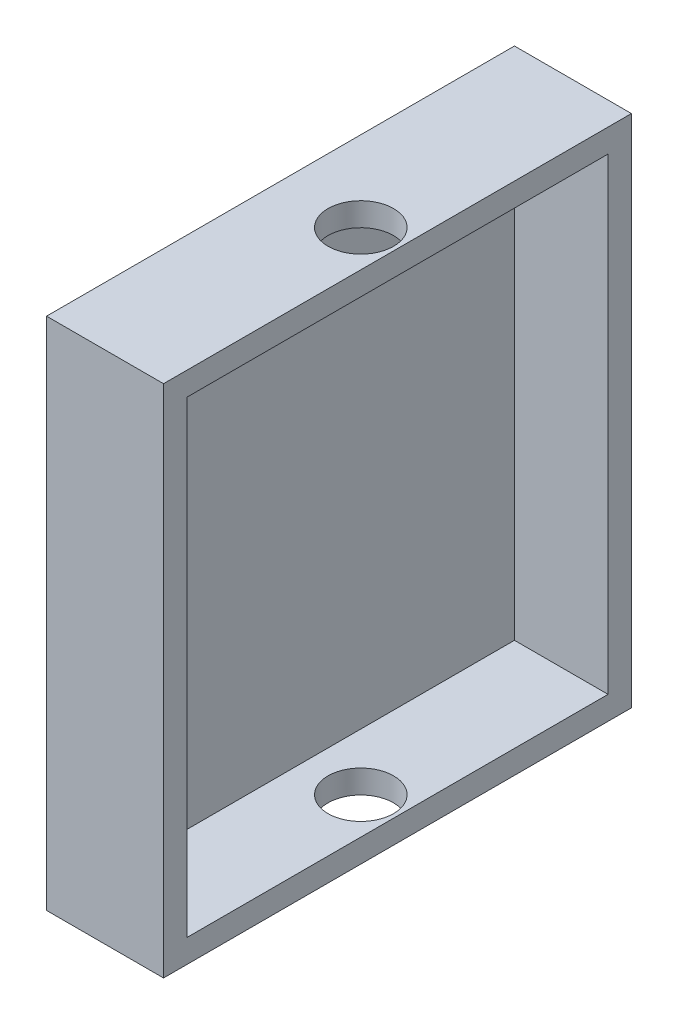
ISO-10303-21;
HEADER;
FILE_DESCRIPTION(('STEP AP214'),'2;1');
FILE_NAME('part.step','',(''),(''),'','','');
FILE_SCHEMA(('AUTOMOTIVE_DESIGN { 1 0 10303 214 1 1 1 1 }'));
ENDSEC;
DATA;
#1=APPLICATION_CONTEXT('core data for automotive mechanical design processes');
#2=APPLICATION_PROTOCOL_DEFINITION('international standard','automotive_design',2000,#1);
#3=PRODUCT_CONTEXT('',#1,'mechanical');
#4=PRODUCT('Part','Part','',(#3));
#5=PRODUCT_RELATED_PRODUCT_CATEGORY('part','',(#4));
#6=PRODUCT_DEFINITION_FORMATION('','',#4);
#7=PRODUCT_DEFINITION_CONTEXT('part definition',#1,'design');
#8=PRODUCT_DEFINITION('design','',#6,#7);
#9=PRODUCT_DEFINITION_SHAPE('','',#8);
#10=(LENGTH_UNIT() NAMED_UNIT(*) SI_UNIT(.MILLI.,.METRE.));
#11=(NAMED_UNIT(*) PLANE_ANGLE_UNIT() SI_UNIT($,.RADIAN.));
#12=(NAMED_UNIT(*) SI_UNIT($,.STERADIAN.) SOLID_ANGLE_UNIT());
#13=UNCERTAINTY_MEASURE_WITH_UNIT(LENGTH_MEASURE(1.E-05),#10,'distance_accuracy_value','');
#14=(GEOMETRIC_REPRESENTATION_CONTEXT(3) GLOBAL_UNCERTAINTY_ASSIGNED_CONTEXT((#13)) GLOBAL_UNIT_ASSIGNED_CONTEXT((#10,
#11,#12)) REPRESENTATION_CONTEXT('',''));
#15=CARTESIAN_POINT('',(0.,0.,0.));
#16=DIRECTION('',(0.,0.,1.));
#17=DIRECTION('',(1.,0.,0.));
#18=AXIS2_PLACEMENT_3D('',#15,#16,#17);
#19=CARTESIAN_POINT('',(0.,0.,0.));
#20=DIRECTION('',(1.,0.,0.));
#21=DIRECTION('',(0.,0.,-1.));
#22=AXIS2_PLACEMENT_3D('',#19,#20,#21);
#23=PLANE('',#22);
#24=DIRECTION('',(0.,0.,-1.));
#25=VECTOR('',#24,1.);
#26=CARTESIAN_POINT('',(0.,-55.,0.));
#27=LINE('',#26,#25);
#28=CARTESIAN_POINT('',(0.,-55.,50.));
#29=VERTEX_POINT('',#28);
#30=CARTESIAN_POINT('',(0.,-55.,-50.));
#31=VERTEX_POINT('',#30);
#32=EDGE_CURVE('E247',#29,#31,#27,.T.);
#33=ORIENTED_EDGE('',*,*,#32,.F.);
#34=DIRECTION('',(0.,1.,0.));
#35=VECTOR('',#34,1.);
#36=CARTESIAN_POINT('',(0.,0.,50.));
#37=LINE('',#36,#35);
#38=CARTESIAN_POINT('',(0.,55.,50.));
#39=VERTEX_POINT('',#38);
#40=EDGE_CURVE('E259',#29,#39,#37,.T.);
#41=ORIENTED_EDGE('',*,*,#40,.T.);
#42=DIRECTION('',(0.,0.,-1.));
#43=VECTOR('',#42,1.);
#44=CARTESIAN_POINT('',(0.,55.,0.));
#45=LINE('',#44,#43);
#46=CARTESIAN_POINT('',(0.,55.,-50.));
#47=VERTEX_POINT('',#46);
#48=EDGE_CURVE('E255',#39,#47,#45,.T.);
#49=ORIENTED_EDGE('',*,*,#48,.T.);
#50=DIRECTION('',(0.,1.,0.));
#51=VECTOR('',#50,1.);
#52=CARTESIAN_POINT('',(0.,0.,-50.));
#53=LINE('',#52,#51);
#54=EDGE_CURVE('E251',#31,#47,#53,.T.);
#55=ORIENTED_EDGE('',*,*,#54,.F.);
#56=EDGE_LOOP('',(#33,#41,#49,#55));
#57=FACE_BOUND('',#56,.T.);
#58=ADVANCED_FACE('F113',(#57),#23,.F.);
#59=CARTESIAN_POINT('',(5.,0.,-50.));
#60=DIRECTION('',(0.,0.,1.));
#61=DIRECTION('',(1.,0.,0.));
#62=AXIS2_PLACEMENT_3D('',#59,#60,#61);
#63=PLANE('',#62);
#64=ORIENTED_EDGE('',*,*,#54,.T.);
#65=DIRECTION('',(-1.,0.,0.));
#66=VECTOR('',#65,1.);
#67=CARTESIAN_POINT('',(5.,55.,-50.));
#68=LINE('',#67,#66);
#69=CARTESIAN_POINT('',(25.,55.,-50.));
#70=VERTEX_POINT('',#69);
#71=EDGE_CURVE('E123',#70,#47,#68,.T.);
#72=ORIENTED_EDGE('',*,*,#71,.F.);
#73=DIRECTION('',(0.,1.,0.));
#74=VECTOR('',#73,1.);
#75=CARTESIAN_POINT('',(25.,-55.,-50.));
#76=LINE('',#75,#74);
#77=CARTESIAN_POINT('',(25.,-55.,-50.));
#78=VERTEX_POINT('',#77);
#79=EDGE_CURVE('E197',#78,#70,#76,.T.);
#80=ORIENTED_EDGE('',*,*,#79,.F.);
#81=DIRECTION('',(-1.,0.,0.));
#82=VECTOR('',#81,1.);
#83=CARTESIAN_POINT('',(5.,-55.,-50.));
#84=LINE('',#83,#82);
#85=EDGE_CURVE('E12',#78,#31,#84,.T.);
#86=ORIENTED_EDGE('',*,*,#85,.T.);
#87=EDGE_LOOP('',(#64,#72,#80,#86));
#88=FACE_BOUND('',#87,.T.);
#89=ADVANCED_FACE('F276',(#88),#63,.F.);
#90=CARTESIAN_POINT('',(5.,55.,0.));
#91=DIRECTION('',(0.,1.,0.));
#92=DIRECTION('',(0.,0.,1.));
#93=AXIS2_PLACEMENT_3D('',#90,#91,#92);
#94=PLANE('',#93);
#95=CARTESIAN_POINT('',(17.16,55.,0.));
#96=DIRECTION('',(0.,-1.,0.));
#97=DIRECTION('',(0.,0.,-1.));
#98=AXIS2_PLACEMENT_3D('',#95,#96,#97);
#99=CIRCLE('',#98,7.);
#100=CARTESIAN_POINT('',(17.16,55.,-7.));
#101=VERTEX_POINT('',#100);
#102=EDGE_CURVE('E309',#101,#101,#99,.T.);
#103=ORIENTED_EDGE('',*,*,#102,.T.);
#104=EDGE_LOOP('',(#103));
#105=FACE_BOUND('',#104,.T.);
#106=ORIENTED_EDGE('',*,*,#48,.F.);
#107=DIRECTION('',(-1.,0.,0.));
#108=VECTOR('',#107,1.);
#109=CARTESIAN_POINT('',(5.,55.,50.));
#110=LINE('',#109,#108);
#111=CARTESIAN_POINT('',(25.,55.,50.));
#112=VERTEX_POINT('',#111);
#113=EDGE_CURVE('E266',#112,#39,#110,.T.);
#114=ORIENTED_EDGE('',*,*,#113,.F.);
#115=DIRECTION('',(0.,0.,1.));
#116=VECTOR('',#115,1.);
#117=CARTESIAN_POINT('',(25.,55.,50.));
#118=LINE('',#117,#116);
#119=EDGE_CURVE('E224',#70,#112,#118,.T.);
#120=ORIENTED_EDGE('',*,*,#119,.F.);
#121=ORIENTED_EDGE('',*,*,#71,.T.);
#122=EDGE_LOOP('',(#106,#114,#120,#121));
#123=FACE_BOUND('',#122,.T.);
#124=ADVANCED_FACE('F273',(#105,#123),#94,.T.);
#125=CARTESIAN_POINT('',(5.,0.,50.));
#126=DIRECTION('',(0.,0.,1.));
#127=DIRECTION('',(1.,0.,0.));
#128=AXIS2_PLACEMENT_3D('',#125,#126,#127);
#129=PLANE('',#128);
#130=ORIENTED_EDGE('',*,*,#40,.F.);
#131=DIRECTION('',(-1.,0.,0.));
#132=VECTOR('',#131,1.);
#133=CARTESIAN_POINT('',(5.,-55.,50.));
#134=LINE('',#133,#132);
#135=CARTESIAN_POINT('',(25.,-55.,50.));
#136=VERTEX_POINT('',#135);
#137=EDGE_CURVE('E263',#136,#29,#134,.T.);
#138=ORIENTED_EDGE('',*,*,#137,.F.);
#139=DIRECTION('',(0.,-1.,0.));
#140=VECTOR('',#139,1.);
#141=CARTESIAN_POINT('',(25.,-55.,50.));
#142=LINE('',#141,#140);
#143=EDGE_CURVE('E228',#112,#136,#142,.T.);
#144=ORIENTED_EDGE('',*,*,#143,.F.);
#145=ORIENTED_EDGE('',*,*,#113,.T.);
#146=EDGE_LOOP('',(#130,#138,#144,#145));
#147=FACE_BOUND('',#146,.T.);
#148=ADVANCED_FACE('F281',(#147),#129,.T.);
#149=CARTESIAN_POINT('',(5.,-55.,0.));
#150=DIRECTION('',(0.,1.,0.));
#151=DIRECTION('',(0.,0.,1.));
#152=AXIS2_PLACEMENT_3D('',#149,#150,#151);
#153=PLANE('',#152);
#154=CARTESIAN_POINT('',(17.16,-55.,0.));
#155=DIRECTION('',(0.,-1.,0.));
#156=DIRECTION('',(0.,0.,-1.));
#157=AXIS2_PLACEMENT_3D('',#154,#155,#156);
#158=CIRCLE('',#157,7.);
#159=CARTESIAN_POINT('',(17.16,-55.,-7.));
#160=VERTEX_POINT('',#159);
#161=EDGE_CURVE('E312',#160,#160,#158,.T.);
#162=ORIENTED_EDGE('',*,*,#161,.F.);
#163=EDGE_LOOP('',(#162));
#164=FACE_BOUND('',#163,.T.);
#165=ORIENTED_EDGE('',*,*,#32,.T.);
#166=ORIENTED_EDGE('',*,*,#85,.F.);
#167=DIRECTION('',(0.,0.,-1.));
#168=VECTOR('',#167,1.);
#169=CARTESIAN_POINT('',(25.,-55.,50.));
#170=LINE('',#169,#168);
#171=EDGE_CURVE('E232',#136,#78,#170,.T.);
#172=ORIENTED_EDGE('',*,*,#171,.F.);
#173=ORIENTED_EDGE('',*,*,#137,.T.);
#174=EDGE_LOOP('',(#165,#166,#172,#173));
#175=FACE_BOUND('',#174,.T.);
#176=ADVANCED_FACE('F115',(#164,#175),#153,.F.);
#177=CARTESIAN_POINT('',(25.,0.,0.));
#178=DIRECTION('',(-1.,0.,0.));
#179=DIRECTION('',(0.,0.,1.));
#180=AXIS2_PLACEMENT_3D('',#177,#178,#179);
#181=PLANE('',#180);
#182=ORIENTED_EDGE('',*,*,#79,.T.);
#183=ORIENTED_EDGE('',*,*,#119,.T.);
#184=ORIENTED_EDGE('',*,*,#143,.T.);
#185=ORIENTED_EDGE('',*,*,#171,.T.);
#186=EDGE_LOOP('',(#182,#183,#184,#185));
#187=FACE_BOUND('',#186,.T.);
#188=DIRECTION('',(0.,1.,0.));
#189=VECTOR('',#188,1.);
#190=CARTESIAN_POINT('',(25.,-50.,-45.));
#191=LINE('',#190,#189);
#192=CARTESIAN_POINT('',(25.,-50.,-45.));
#193=VERTEX_POINT('',#192);
#194=CARTESIAN_POINT('',(25.,50.,-45.));
#195=VERTEX_POINT('',#194);
#196=EDGE_CURVE('E179',#193,#195,#191,.T.);
#197=ORIENTED_EDGE('',*,*,#196,.F.);
#198=DIRECTION('',(0.,0.,-1.));
#199=VECTOR('',#198,1.);
#200=CARTESIAN_POINT('',(25.,-50.,45.));
#201=LINE('',#200,#199);
#202=CARTESIAN_POINT('',(25.,-50.,45.));
#203=VERTEX_POINT('',#202);
#204=EDGE_CURVE('E207',#203,#193,#201,.T.);
#205=ORIENTED_EDGE('',*,*,#204,.F.);
#206=DIRECTION('',(0.,-1.,0.));
#207=VECTOR('',#206,1.);
#208=CARTESIAN_POINT('',(25.,-50.,45.));
#209=LINE('',#208,#207);
#210=CARTESIAN_POINT('',(25.,50.,45.));
#211=VERTEX_POINT('',#210);
#212=EDGE_CURVE('E203',#211,#203,#209,.T.);
#213=ORIENTED_EDGE('',*,*,#212,.F.);
#214=DIRECTION('',(0.,0.,1.));
#215=VECTOR('',#214,1.);
#216=CARTESIAN_POINT('',(25.,50.,45.));
#217=LINE('',#216,#215);
#218=EDGE_CURVE('E189',#195,#211,#217,.T.);
#219=ORIENTED_EDGE('',*,*,#218,.F.);
#220=EDGE_LOOP('',(#197,#205,#213,#219));
#221=FACE_BOUND('',#220,.T.);
#222=ADVANCED_FACE('F201',(#187,#221),#181,.F.);
#223=CARTESIAN_POINT('',(25.,-50.,-45.));
#224=DIRECTION('',(0.,0.,1.));
#225=DIRECTION('',(1.,0.,0.));
#226=AXIS2_PLACEMENT_3D('',#223,#224,#225);
#227=PLANE('',#226);
#228=DIRECTION('',(-1.,0.,0.));
#229=VECTOR('',#228,1.);
#230=CARTESIAN_POINT('',(25.,50.,-45.));
#231=LINE('',#230,#229);
#232=CARTESIAN_POINT('',(5.,50.,-45.));
#233=VERTEX_POINT('',#232);
#234=EDGE_CURVE('E182',#195,#233,#231,.T.);
#235=ORIENTED_EDGE('',*,*,#234,.T.);
#236=DIRECTION('',(0.,-1.,0.));
#237=VECTOR('',#236,1.);
#238=CARTESIAN_POINT('',(5.,0.,-45.));
#239=LINE('',#238,#237);
#240=CARTESIAN_POINT('',(5.,-50.,-45.));
#241=VERTEX_POINT('',#240);
#242=EDGE_CURVE('E130',#233,#241,#239,.T.);
#243=ORIENTED_EDGE('',*,*,#242,.T.);
#244=DIRECTION('',(-1.,0.,0.));
#245=VECTOR('',#244,1.);
#246=CARTESIAN_POINT('',(25.,-50.,-45.));
#247=LINE('',#246,#245);
#248=EDGE_CURVE('E184',#193,#241,#247,.T.);
#249=ORIENTED_EDGE('',*,*,#248,.F.);
#250=ORIENTED_EDGE('',*,*,#196,.T.);
#251=EDGE_LOOP('',(#235,#243,#249,#250));
#252=FACE_BOUND('',#251,.T.);
#253=ADVANCED_FACE('F181',(#252),#227,.T.);
#254=CARTESIAN_POINT('',(25.,50.,45.));
#255=DIRECTION('',(0.,-1.,0.));
#256=DIRECTION('',(0.,0.,-1.));
#257=AXIS2_PLACEMENT_3D('',#254,#255,#256);
#258=PLANE('',#257);
#259=CARTESIAN_POINT('',(17.16,50.,0.));
#260=DIRECTION('',(0.,-1.,0.));
#261=DIRECTION('',(0.,0.,-1.));
#262=AXIS2_PLACEMENT_3D('',#259,#260,#261);
#263=CIRCLE('',#262,7.);
#264=CARTESIAN_POINT('',(17.16,50.,-7.));
#265=VERTEX_POINT('',#264);
#266=EDGE_CURVE('E190',#265,#265,#263,.T.);
#267=ORIENTED_EDGE('',*,*,#266,.F.);
#268=EDGE_LOOP('',(#267));
#269=FACE_BOUND('',#268,.T.);
#270=DIRECTION('',(-1.,0.,0.));
#271=VECTOR('',#270,1.);
#272=CARTESIAN_POINT('',(25.,50.,45.));
#273=LINE('',#272,#271);
#274=CARTESIAN_POINT('',(5.,50.,45.));
#275=VERTEX_POINT('',#274);
#276=EDGE_CURVE('E198',#211,#275,#273,.T.);
#277=ORIENTED_EDGE('',*,*,#276,.T.);
#278=DIRECTION('',(0.,0.,-1.));
#279=VECTOR('',#278,1.);
#280=CARTESIAN_POINT('',(5.,50.,0.));
#281=LINE('',#280,#279);
#282=EDGE_CURVE('E134',#275,#233,#281,.T.);
#283=ORIENTED_EDGE('',*,*,#282,.T.);
#284=ORIENTED_EDGE('',*,*,#234,.F.);
#285=ORIENTED_EDGE('',*,*,#218,.T.);
#286=EDGE_LOOP('',(#277,#283,#284,#285));
#287=FACE_BOUND('',#286,.T.);
#288=ADVANCED_FACE('F194',(#269,#287),#258,.T.);
#289=CARTESIAN_POINT('',(25.,-50.,45.));
#290=DIRECTION('',(0.,0.,-1.));
#291=DIRECTION('',(-1.,0.,0.));
#292=AXIS2_PLACEMENT_3D('',#289,#290,#291);
#293=PLANE('',#292);
#294=DIRECTION('',(-1.,0.,0.));
#295=VECTOR('',#294,1.);
#296=CARTESIAN_POINT('',(25.,-50.,45.));
#297=LINE('',#296,#295);
#298=CARTESIAN_POINT('',(5.,-50.,45.));
#299=VERTEX_POINT('',#298);
#300=EDGE_CURVE('E215',#203,#299,#297,.T.);
#301=ORIENTED_EDGE('',*,*,#300,.T.);
#302=DIRECTION('',(0.,1.,0.));
#303=VECTOR('',#302,1.);
#304=CARTESIAN_POINT('',(5.,0.,45.));
#305=LINE('',#304,#303);
#306=EDGE_CURVE('E240',#299,#275,#305,.T.);
#307=ORIENTED_EDGE('',*,*,#306,.T.);
#308=ORIENTED_EDGE('',*,*,#276,.F.);
#309=ORIENTED_EDGE('',*,*,#212,.T.);
#310=EDGE_LOOP('',(#301,#307,#308,#309));
#311=FACE_BOUND('',#310,.T.);
#312=ADVANCED_FACE('F326',(#311),#293,.T.);
#313=CARTESIAN_POINT('',(25.,-50.,45.));
#314=DIRECTION('',(0.,1.,0.));
#315=DIRECTION('',(0.,0.,1.));
#316=AXIS2_PLACEMENT_3D('',#313,#314,#315);
#317=PLANE('',#316);
#318=CARTESIAN_POINT('',(17.16,-50.,0.));
#319=DIRECTION('',(0.,1.,0.));
#320=DIRECTION('',(0.,0.,1.));
#321=AXIS2_PLACEMENT_3D('',#318,#319,#320);
#322=CIRCLE('',#321,7.);
#323=CARTESIAN_POINT('',(17.16,-50.,7.));
#324=VERTEX_POINT('',#323);
#325=EDGE_CURVE('E117',#324,#324,#322,.T.);
#326=ORIENTED_EDGE('',*,*,#325,.F.);
#327=EDGE_LOOP('',(#326));
#328=FACE_BOUND('',#327,.T.);
#329=ORIENTED_EDGE('',*,*,#248,.T.);
#330=DIRECTION('',(0.,0.,1.));
#331=VECTOR('',#330,1.);
#332=CARTESIAN_POINT('',(5.,-50.,0.));
#333=LINE('',#332,#331);
#334=EDGE_CURVE('E236',#241,#299,#333,.T.);
#335=ORIENTED_EDGE('',*,*,#334,.T.);
#336=ORIENTED_EDGE('',*,*,#300,.F.);
#337=ORIENTED_EDGE('',*,*,#204,.T.);
#338=EDGE_LOOP('',(#329,#335,#336,#337));
#339=FACE_BOUND('',#338,.T.);
#340=ADVANCED_FACE('F332',(#328,#339),#317,.T.);
#341=CARTESIAN_POINT('',(5.,0.,0.));
#342=DIRECTION('',(1.,0.,0.));
#343=DIRECTION('',(0.,0.,-1.));
#344=AXIS2_PLACEMENT_3D('',#341,#342,#343);
#345=PLANE('',#344);
#346=ORIENTED_EDGE('',*,*,#242,.F.);
#347=ORIENTED_EDGE('',*,*,#282,.F.);
#348=ORIENTED_EDGE('',*,*,#306,.F.);
#349=ORIENTED_EDGE('',*,*,#334,.F.);
#350=EDGE_LOOP('',(#346,#347,#348,#349));
#351=FACE_BOUND('',#350,.T.);
#352=ADVANCED_FACE('F301',(#351),#345,.T.);
#353=CARTESIAN_POINT('',(17.16,55.,0.));
#354=DIRECTION('',(0.,-1.,0.));
#355=DIRECTION('',(0.,0.,-1.));
#356=AXIS2_PLACEMENT_3D('',#353,#354,#355);
#357=CYLINDRICAL_SURFACE('',#356,7.);
#358=ORIENTED_EDGE('',*,*,#325,.T.);
#359=EDGE_LOOP('',(#358));
#360=FACE_BOUND('',#359,.T.);
#361=ORIENTED_EDGE('',*,*,#161,.T.);
#362=EDGE_LOOP('',(#361));
#363=FACE_BOUND('',#362,.T.);
#364=ADVANCED_FACE('F340',(#360,#363),#357,.F.);
#365=ORIENTED_EDGE('',*,*,#266,.T.);
#366=EDGE_LOOP('',(#365));
#367=FACE_BOUND('',#366,.T.);
#368=ORIENTED_EDGE('',*,*,#102,.F.);
#369=EDGE_LOOP('',(#368));
#370=FACE_BOUND('',#369,.T.);
#371=ADVANCED_FACE('F323',(#367,#370),#357,.F.);
#372=CLOSED_SHELL('',(#58,#89,#124,#148,#176,#222,#253,#288,#312,#340,#352,#364,#371));
#373=MANIFOLD_SOLID_BREP('B2',#372);
#374=ADVANCED_BREP_SHAPE_REPRESENTATION('',(#18,#373),#14);
#375=SHAPE_DEFINITION_REPRESENTATION(#9,#374);
ENDSEC;
END-ISO-10303-21;
